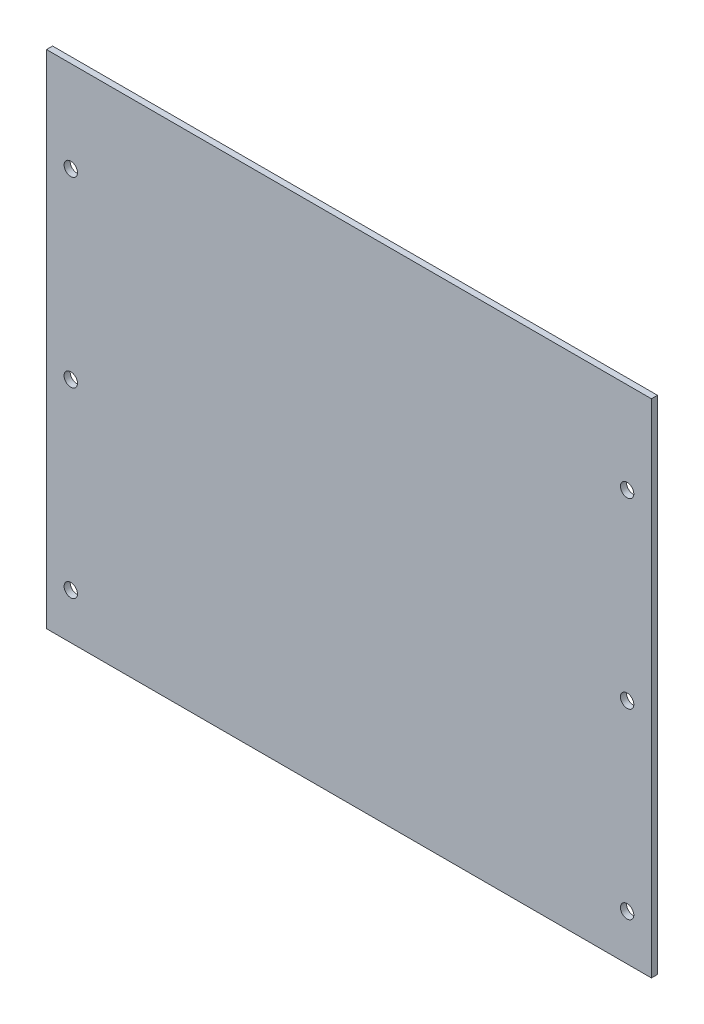
ISO-10303-21;
HEADER;
FILE_DESCRIPTION(('STEP AP214'),'2;1');
FILE_NAME('part.step','',(''),(''),'','','');
FILE_SCHEMA(('AUTOMOTIVE_DESIGN { 1 0 10303 214 1 1 1 1 }'));
ENDSEC;
DATA;
#1=APPLICATION_CONTEXT('core data for automotive mechanical design processes');
#2=APPLICATION_PROTOCOL_DEFINITION('international standard','automotive_design',2000,#1);
#3=PRODUCT_CONTEXT('',#1,'mechanical');
#4=PRODUCT('Part','Part','',(#3));
#5=PRODUCT_RELATED_PRODUCT_CATEGORY('part','',(#4));
#6=PRODUCT_DEFINITION_FORMATION('','',#4);
#7=PRODUCT_DEFINITION_CONTEXT('part definition',#1,'design');
#8=PRODUCT_DEFINITION('design','',#6,#7);
#9=PRODUCT_DEFINITION_SHAPE('','',#8);
#10=(LENGTH_UNIT() NAMED_UNIT(*) SI_UNIT(.MILLI.,.METRE.));
#11=(NAMED_UNIT(*) PLANE_ANGLE_UNIT() SI_UNIT($,.RADIAN.));
#12=(NAMED_UNIT(*) SI_UNIT($,.STERADIAN.) SOLID_ANGLE_UNIT());
#13=UNCERTAINTY_MEASURE_WITH_UNIT(LENGTH_MEASURE(1.E-05),#10,'distance_accuracy_value','');
#14=(GEOMETRIC_REPRESENTATION_CONTEXT(3) GLOBAL_UNCERTAINTY_ASSIGNED_CONTEXT((#13)) GLOBAL_UNIT_ASSIGNED_CONTEXT((#10,
#11,#12)) REPRESENTATION_CONTEXT('',''));
#15=CARTESIAN_POINT('',(0.,0.,0.));
#16=DIRECTION('',(0.,0.,1.));
#17=DIRECTION('',(1.,0.,0.));
#18=AXIS2_PLACEMENT_3D('',#15,#16,#17);
#19=CARTESIAN_POINT('',(99.5,82.5,2.));
#20=DIRECTION('',(-1.,0.,0.));
#21=DIRECTION('',(0.,-1.,0.));
#22=AXIS2_PLACEMENT_3D('',#19,#20,#21);
#23=PLANE('',#22);
#24=DIRECTION('',(0.,1.,0.));
#25=VECTOR('',#24,1.);
#26=CARTESIAN_POINT('',(99.5,82.5,0.));
#27=LINE('',#26,#25);
#28=CARTESIAN_POINT('',(99.5,-82.5,0.));
#29=VERTEX_POINT('',#28);
#30=CARTESIAN_POINT('',(99.5,82.5,0.));
#31=VERTEX_POINT('',#30);
#32=EDGE_CURVE('E107',#29,#31,#27,.T.);
#33=ORIENTED_EDGE('',*,*,#32,.T.);
#34=DIRECTION('',(0.,0.,-1.));
#35=VECTOR('',#34,1.);
#36=CARTESIAN_POINT('',(99.5,82.5,2.));
#37=LINE('',#36,#35);
#38=CARTESIAN_POINT('',(99.5,82.5,2.));
#39=VERTEX_POINT('',#38);
#40=EDGE_CURVE('E11',#39,#31,#37,.T.);
#41=ORIENTED_EDGE('',*,*,#40,.F.);
#42=DIRECTION('',(0.,1.,0.));
#43=VECTOR('',#42,1.);
#44=CARTESIAN_POINT('',(99.5,82.5,2.));
#45=LINE('',#44,#43);
#46=CARTESIAN_POINT('',(99.5,-82.5,2.));
#47=VERTEX_POINT('',#46);
#48=EDGE_CURVE('E91',#47,#39,#45,.T.);
#49=ORIENTED_EDGE('',*,*,#48,.F.);
#50=DIRECTION('',(0.,0.,-1.));
#51=VECTOR('',#50,1.);
#52=CARTESIAN_POINT('',(99.5,-82.5,2.));
#53=LINE('',#52,#51);
#54=EDGE_CURVE('E103',#47,#29,#53,.T.);
#55=ORIENTED_EDGE('',*,*,#54,.T.);
#56=EDGE_LOOP('',(#33,#41,#49,#55));
#57=FACE_BOUND('',#56,.T.);
#58=ADVANCED_FACE('F39',(#57),#23,.F.);
#59=CARTESIAN_POINT('',(-99.5,82.5,2.));
#60=DIRECTION('',(0.,-1.,0.));
#61=DIRECTION('',(0.,0.,-1.));
#62=AXIS2_PLACEMENT_3D('',#59,#60,#61);
#63=PLANE('',#62);
#64=DIRECTION('',(-1.,0.,0.));
#65=VECTOR('',#64,1.);
#66=CARTESIAN_POINT('',(-99.5,82.5,0.));
#67=LINE('',#66,#65);
#68=CARTESIAN_POINT('',(-99.5,82.5,0.));
#69=VERTEX_POINT('',#68);
#70=EDGE_CURVE('E96',#31,#69,#67,.T.);
#71=ORIENTED_EDGE('',*,*,#70,.T.);
#72=DIRECTION('',(0.,0.,-1.));
#73=VECTOR('',#72,1.);
#74=CARTESIAN_POINT('',(-99.5,82.5,2.));
#75=LINE('',#74,#73);
#76=CARTESIAN_POINT('',(-99.5,82.5,2.));
#77=VERTEX_POINT('',#76);
#78=EDGE_CURVE('E48',#77,#69,#75,.T.);
#79=ORIENTED_EDGE('',*,*,#78,.F.);
#80=DIRECTION('',(-1.,0.,0.));
#81=VECTOR('',#80,1.);
#82=CARTESIAN_POINT('',(-99.5,82.5,2.));
#83=LINE('',#82,#81);
#84=EDGE_CURVE('E86',#39,#77,#83,.T.);
#85=ORIENTED_EDGE('',*,*,#84,.F.);
#86=ORIENTED_EDGE('',*,*,#40,.T.);
#87=EDGE_LOOP('',(#71,#79,#85,#86));
#88=FACE_BOUND('',#87,.T.);
#89=ADVANCED_FACE('F95',(#88),#63,.F.);
#90=CARTESIAN_POINT('',(-99.5,82.5,2.));
#91=DIRECTION('',(1.,0.,0.));
#92=DIRECTION('',(0.,1.,0.));
#93=AXIS2_PLACEMENT_3D('',#90,#91,#92);
#94=PLANE('',#93);
#95=DIRECTION('',(0.,-1.,0.));
#96=VECTOR('',#95,1.);
#97=CARTESIAN_POINT('',(-99.5,82.5,0.));
#98=LINE('',#97,#96);
#99=CARTESIAN_POINT('',(-99.5,-82.5,0.));
#100=VERTEX_POINT('',#99);
#101=EDGE_CURVE('E73',#69,#100,#98,.T.);
#102=ORIENTED_EDGE('',*,*,#101,.T.);
#103=DIRECTION('',(0.,0.,-1.));
#104=VECTOR('',#103,1.);
#105=CARTESIAN_POINT('',(-99.5,-82.5,2.));
#106=LINE('',#105,#104);
#107=CARTESIAN_POINT('',(-99.5,-82.5,2.));
#108=VERTEX_POINT('',#107);
#109=EDGE_CURVE('E98',#108,#100,#106,.T.);
#110=ORIENTED_EDGE('',*,*,#109,.F.);
#111=DIRECTION('',(0.,-1.,0.));
#112=VECTOR('',#111,1.);
#113=CARTESIAN_POINT('',(-99.5,82.5,2.));
#114=LINE('',#113,#112);
#115=EDGE_CURVE('E89',#77,#108,#114,.T.);
#116=ORIENTED_EDGE('',*,*,#115,.F.);
#117=ORIENTED_EDGE('',*,*,#78,.T.);
#118=EDGE_LOOP('',(#102,#110,#116,#117));
#119=FACE_BOUND('',#118,.T.);
#120=ADVANCED_FACE('F99',(#119),#94,.F.);
#121=CARTESIAN_POINT('',(-99.5,-82.5,2.));
#122=DIRECTION('',(0.,1.,0.));
#123=DIRECTION('',(0.,0.,1.));
#124=AXIS2_PLACEMENT_3D('',#121,#122,#123);
#125=PLANE('',#124);
#126=DIRECTION('',(1.,0.,0.));
#127=VECTOR('',#126,1.);
#128=CARTESIAN_POINT('',(-99.5,-82.5,0.));
#129=LINE('',#128,#127);
#130=EDGE_CURVE('E79',#100,#29,#129,.T.);
#131=ORIENTED_EDGE('',*,*,#130,.T.);
#132=ORIENTED_EDGE('',*,*,#54,.F.);
#133=DIRECTION('',(1.,0.,0.));
#134=VECTOR('',#133,1.);
#135=CARTESIAN_POINT('',(-99.5,-82.5,2.));
#136=LINE('',#135,#134);
#137=EDGE_CURVE('E56',#108,#47,#136,.T.);
#138=ORIENTED_EDGE('',*,*,#137,.F.);
#139=ORIENTED_EDGE('',*,*,#109,.T.);
#140=EDGE_LOOP('',(#131,#132,#138,#139));
#141=FACE_BOUND('',#140,.T.);
#142=ADVANCED_FACE('F121',(#141),#125,.F.);
#143=CARTESIAN_POINT('',(0.,0.,2.));
#144=DIRECTION('',(0.,0.,1.));
#145=DIRECTION('',(1.,0.,0.));
#146=AXIS2_PLACEMENT_3D('',#143,#144,#145);
#147=PLANE('',#146);
#148=CARTESIAN_POINT('',(91.5,52.5,2.));
#149=DIRECTION('',(0.,0.,1.));
#150=DIRECTION('',(1.,0.,0.));
#151=AXIS2_PLACEMENT_3D('',#148,#149,#150);
#152=CIRCLE('',#151,2.20000000000001);
#153=CARTESIAN_POINT('',(93.7,52.5,2.));
#154=VERTEX_POINT('',#153);
#155=EDGE_CURVE('E168',#154,#154,#152,.T.);
#156=ORIENTED_EDGE('',*,*,#155,.F.);
#157=EDGE_LOOP('',(#156));
#158=FACE_BOUND('',#157,.T.);
#159=CARTESIAN_POINT('',(91.5,-7.50000000000002,2.));
#160=DIRECTION('',(0.,0.,1.));
#161=DIRECTION('',(1.,0.,0.));
#162=AXIS2_PLACEMENT_3D('',#159,#160,#161);
#163=CIRCLE('',#162,2.20000000000001);
#164=CARTESIAN_POINT('',(93.7,-7.50000000000002,2.));
#165=VERTEX_POINT('',#164);
#166=EDGE_CURVE('E160',#165,#165,#163,.T.);
#167=ORIENTED_EDGE('',*,*,#166,.F.);
#168=EDGE_LOOP('',(#167));
#169=FACE_BOUND('',#168,.T.);
#170=CARTESIAN_POINT('',(91.5,-67.5,2.));
#171=DIRECTION('',(0.,0.,1.));
#172=DIRECTION('',(1.,0.,0.));
#173=AXIS2_PLACEMENT_3D('',#170,#171,#172);
#174=CIRCLE('',#173,2.2);
#175=CARTESIAN_POINT('',(93.7,-67.5,2.));
#176=VERTEX_POINT('',#175);
#177=EDGE_CURVE('E152',#176,#176,#174,.T.);
#178=ORIENTED_EDGE('',*,*,#177,.F.);
#179=EDGE_LOOP('',(#178));
#180=FACE_BOUND('',#179,.T.);
#181=CARTESIAN_POINT('',(-91.5,52.5,2.));
#182=DIRECTION('',(0.,0.,1.));
#183=DIRECTION('',(1.,0.,0.));
#184=AXIS2_PLACEMENT_3D('',#181,#182,#183);
#185=CIRCLE('',#184,2.2);
#186=CARTESIAN_POINT('',(-89.3,52.5,2.));
#187=VERTEX_POINT('',#186);
#188=EDGE_CURVE('E145',#187,#187,#185,.T.);
#189=ORIENTED_EDGE('',*,*,#188,.F.);
#190=EDGE_LOOP('',(#189));
#191=FACE_BOUND('',#190,.T.);
#192=CARTESIAN_POINT('',(-91.5,-7.50000000000002,2.));
#193=DIRECTION('',(0.,0.,1.));
#194=DIRECTION('',(1.,0.,0.));
#195=AXIS2_PLACEMENT_3D('',#192,#193,#194);
#196=CIRCLE('',#195,2.2);
#197=CARTESIAN_POINT('',(-89.3,-7.50000000000002,2.));
#198=VERTEX_POINT('',#197);
#199=EDGE_CURVE('E137',#198,#198,#196,.T.);
#200=ORIENTED_EDGE('',*,*,#199,.F.);
#201=EDGE_LOOP('',(#200));
#202=FACE_BOUND('',#201,.T.);
#203=CARTESIAN_POINT('',(-91.5,-67.5,2.));
#204=DIRECTION('',(0.,0.,1.));
#205=DIRECTION('',(1.,0.,0.));
#206=AXIS2_PLACEMENT_3D('',#203,#204,#205);
#207=CIRCLE('',#206,2.2);
#208=CARTESIAN_POINT('',(-89.3,-67.5,2.));
#209=VERTEX_POINT('',#208);
#210=EDGE_CURVE('E128',#209,#209,#207,.T.);
#211=ORIENTED_EDGE('',*,*,#210,.F.);
#212=EDGE_LOOP('',(#211));
#213=FACE_BOUND('',#212,.T.);
#214=ORIENTED_EDGE('',*,*,#48,.T.);
#215=ORIENTED_EDGE('',*,*,#84,.T.);
#216=ORIENTED_EDGE('',*,*,#115,.T.);
#217=ORIENTED_EDGE('',*,*,#137,.T.);
#218=EDGE_LOOP('',(#214,#215,#216,#217));
#219=FACE_BOUND('',#218,.T.);
#220=ADVANCED_FACE('F87',(#158,#169,#180,#191,#202,#213,#219),#147,.T.);
#221=CARTESIAN_POINT('',(0.,0.,0.));
#222=DIRECTION('',(0.,0.,1.));
#223=DIRECTION('',(1.,0.,0.));
#224=AXIS2_PLACEMENT_3D('',#221,#222,#223);
#225=PLANE('',#224);
#226=CARTESIAN_POINT('',(91.5,52.5,0.));
#227=DIRECTION('',(0.,0.,1.));
#228=DIRECTION('',(1.,0.,0.));
#229=AXIS2_PLACEMENT_3D('',#226,#227,#228);
#230=CIRCLE('',#229,2.20000000000001);
#231=CARTESIAN_POINT('',(93.7,52.5,0.));
#232=VERTEX_POINT('',#231);
#233=EDGE_CURVE('E133',#232,#232,#230,.T.);
#234=ORIENTED_EDGE('',*,*,#233,.T.);
#235=EDGE_LOOP('',(#234));
#236=FACE_BOUND('',#235,.T.);
#237=CARTESIAN_POINT('',(91.5,-7.50000000000002,0.));
#238=DIRECTION('',(0.,0.,1.));
#239=DIRECTION('',(1.,0.,0.));
#240=AXIS2_PLACEMENT_3D('',#237,#238,#239);
#241=CIRCLE('',#240,2.20000000000001);
#242=CARTESIAN_POINT('',(93.7,-7.50000000000002,0.));
#243=VERTEX_POINT('',#242);
#244=EDGE_CURVE('E164',#243,#243,#241,.T.);
#245=ORIENTED_EDGE('',*,*,#244,.T.);
#246=EDGE_LOOP('',(#245));
#247=FACE_BOUND('',#246,.T.);
#248=CARTESIAN_POINT('',(91.5,-67.5,0.));
#249=DIRECTION('',(0.,0.,1.));
#250=DIRECTION('',(1.,0.,0.));
#251=AXIS2_PLACEMENT_3D('',#248,#249,#250);
#252=CIRCLE('',#251,2.2);
#253=CARTESIAN_POINT('',(93.7,-67.5,0.));
#254=VERTEX_POINT('',#253);
#255=EDGE_CURVE('E156',#254,#254,#252,.T.);
#256=ORIENTED_EDGE('',*,*,#255,.T.);
#257=EDGE_LOOP('',(#256));
#258=FACE_BOUND('',#257,.T.);
#259=CARTESIAN_POINT('',(-91.5,52.5,0.));
#260=DIRECTION('',(0.,0.,1.));
#261=DIRECTION('',(1.,0.,0.));
#262=AXIS2_PLACEMENT_3D('',#259,#260,#261);
#263=CIRCLE('',#262,2.2);
#264=CARTESIAN_POINT('',(-89.3,52.5,0.));
#265=VERTEX_POINT('',#264);
#266=EDGE_CURVE('E111',#265,#265,#263,.T.);
#267=ORIENTED_EDGE('',*,*,#266,.T.);
#268=EDGE_LOOP('',(#267));
#269=FACE_BOUND('',#268,.T.);
#270=CARTESIAN_POINT('',(-91.5,-7.50000000000002,0.));
#271=DIRECTION('',(0.,0.,1.));
#272=DIRECTION('',(1.,0.,0.));
#273=AXIS2_PLACEMENT_3D('',#270,#271,#272);
#274=CIRCLE('',#273,2.2);
#275=CARTESIAN_POINT('',(-89.3,-7.50000000000002,0.));
#276=VERTEX_POINT('',#275);
#277=EDGE_CURVE('E141',#276,#276,#274,.T.);
#278=ORIENTED_EDGE('',*,*,#277,.T.);
#279=EDGE_LOOP('',(#278));
#280=FACE_BOUND('',#279,.T.);
#281=CARTESIAN_POINT('',(-91.5,-67.5,0.));
#282=DIRECTION('',(0.,0.,1.));
#283=DIRECTION('',(1.,0.,0.));
#284=AXIS2_PLACEMENT_3D('',#281,#282,#283);
#285=CIRCLE('',#284,2.2);
#286=CARTESIAN_POINT('',(-89.3,-67.5,0.));
#287=VERTEX_POINT('',#286);
#288=EDGE_CURVE('E132',#287,#287,#285,.T.);
#289=ORIENTED_EDGE('',*,*,#288,.T.);
#290=EDGE_LOOP('',(#289));
#291=FACE_BOUND('',#290,.T.);
#292=ORIENTED_EDGE('',*,*,#32,.F.);
#293=ORIENTED_EDGE('',*,*,#130,.F.);
#294=ORIENTED_EDGE('',*,*,#101,.F.);
#295=ORIENTED_EDGE('',*,*,#70,.F.);
#296=EDGE_LOOP('',(#292,#293,#294,#295));
#297=FACE_BOUND('',#296,.T.);
#298=ADVANCED_FACE('F124',(#236,#247,#258,#269,#280,#291,#297),#225,.F.);
#299=CARTESIAN_POINT('',(-91.5,-67.5,0.));
#300=DIRECTION('',(0.,0.,1.));
#301=DIRECTION('',(1.,0.,0.));
#302=AXIS2_PLACEMENT_3D('',#299,#300,#301);
#303=CYLINDRICAL_SURFACE('',#302,2.2);
#304=ORIENTED_EDGE('',*,*,#288,.F.);
#305=EDGE_LOOP('',(#304));
#306=FACE_BOUND('',#305,.T.);
#307=ORIENTED_EDGE('',*,*,#210,.T.);
#308=EDGE_LOOP('',(#307));
#309=FACE_BOUND('',#308,.T.);
#310=ADVANCED_FACE('F198',(#306,#309),#303,.F.);
#311=CARTESIAN_POINT('',(-91.5,-7.50000000000002,0.));
#312=DIRECTION('',(0.,0.,1.));
#313=DIRECTION('',(1.,0.,0.));
#314=AXIS2_PLACEMENT_3D('',#311,#312,#313);
#315=CYLINDRICAL_SURFACE('',#314,2.2);
#316=ORIENTED_EDGE('',*,*,#277,.F.);
#317=EDGE_LOOP('',(#316));
#318=FACE_BOUND('',#317,.T.);
#319=ORIENTED_EDGE('',*,*,#199,.T.);
#320=EDGE_LOOP('',(#319));
#321=FACE_BOUND('',#320,.T.);
#322=ADVANCED_FACE('F200',(#318,#321),#315,.F.);
#323=CARTESIAN_POINT('',(-91.5,52.5,0.));
#324=DIRECTION('',(0.,0.,1.));
#325=DIRECTION('',(1.,0.,0.));
#326=AXIS2_PLACEMENT_3D('',#323,#324,#325);
#327=CYLINDRICAL_SURFACE('',#326,2.2);
#328=ORIENTED_EDGE('',*,*,#266,.F.);
#329=EDGE_LOOP('',(#328));
#330=FACE_BOUND('',#329,.T.);
#331=ORIENTED_EDGE('',*,*,#188,.T.);
#332=EDGE_LOOP('',(#331));
#333=FACE_BOUND('',#332,.T.);
#334=ADVANCED_FACE('F207',(#330,#333),#327,.F.);
#335=CARTESIAN_POINT('',(91.5,-67.5,0.));
#336=DIRECTION('',(0.,0.,1.));
#337=DIRECTION('',(1.,0.,0.));
#338=AXIS2_PLACEMENT_3D('',#335,#336,#337);
#339=CYLINDRICAL_SURFACE('',#338,2.2);
#340=ORIENTED_EDGE('',*,*,#255,.F.);
#341=EDGE_LOOP('',(#340));
#342=FACE_BOUND('',#341,.T.);
#343=ORIENTED_EDGE('',*,*,#177,.T.);
#344=EDGE_LOOP('',(#343));
#345=FACE_BOUND('',#344,.T.);
#346=ADVANCED_FACE('F241',(#342,#345),#339,.F.);
#347=CARTESIAN_POINT('',(91.5,-7.50000000000002,0.));
#348=DIRECTION('',(0.,0.,1.));
#349=DIRECTION('',(1.,0.,0.));
#350=AXIS2_PLACEMENT_3D('',#347,#348,#349);
#351=CYLINDRICAL_SURFACE('',#350,2.20000000000001);
#352=ORIENTED_EDGE('',*,*,#244,.F.);
#353=EDGE_LOOP('',(#352));
#354=FACE_BOUND('',#353,.T.);
#355=ORIENTED_EDGE('',*,*,#166,.T.);
#356=EDGE_LOOP('',(#355));
#357=FACE_BOUND('',#356,.T.);
#358=ADVANCED_FACE('F181',(#354,#357),#351,.F.);
#359=CARTESIAN_POINT('',(91.5,52.5,0.));
#360=DIRECTION('',(0.,0.,1.));
#361=DIRECTION('',(1.,0.,0.));
#362=AXIS2_PLACEMENT_3D('',#359,#360,#361);
#363=CYLINDRICAL_SURFACE('',#362,2.20000000000001);
#364=ORIENTED_EDGE('',*,*,#233,.F.);
#365=EDGE_LOOP('',(#364));
#366=FACE_BOUND('',#365,.T.);
#367=ORIENTED_EDGE('',*,*,#155,.T.);
#368=EDGE_LOOP('',(#367));
#369=FACE_BOUND('',#368,.T.);
#370=ADVANCED_FACE('F178',(#366,#369),#363,.F.);
#371=CLOSED_SHELL('',(#58,#89,#120,#142,#220,#298,#310,#322,#334,#346,#358,#370));
#372=MANIFOLD_SOLID_BREP('B2',#371);
#373=ADVANCED_BREP_SHAPE_REPRESENTATION('',(#18,#372),#14);
#374=SHAPE_DEFINITION_REPRESENTATION(#9,#373);
ENDSEC;
END-ISO-10303-21;
